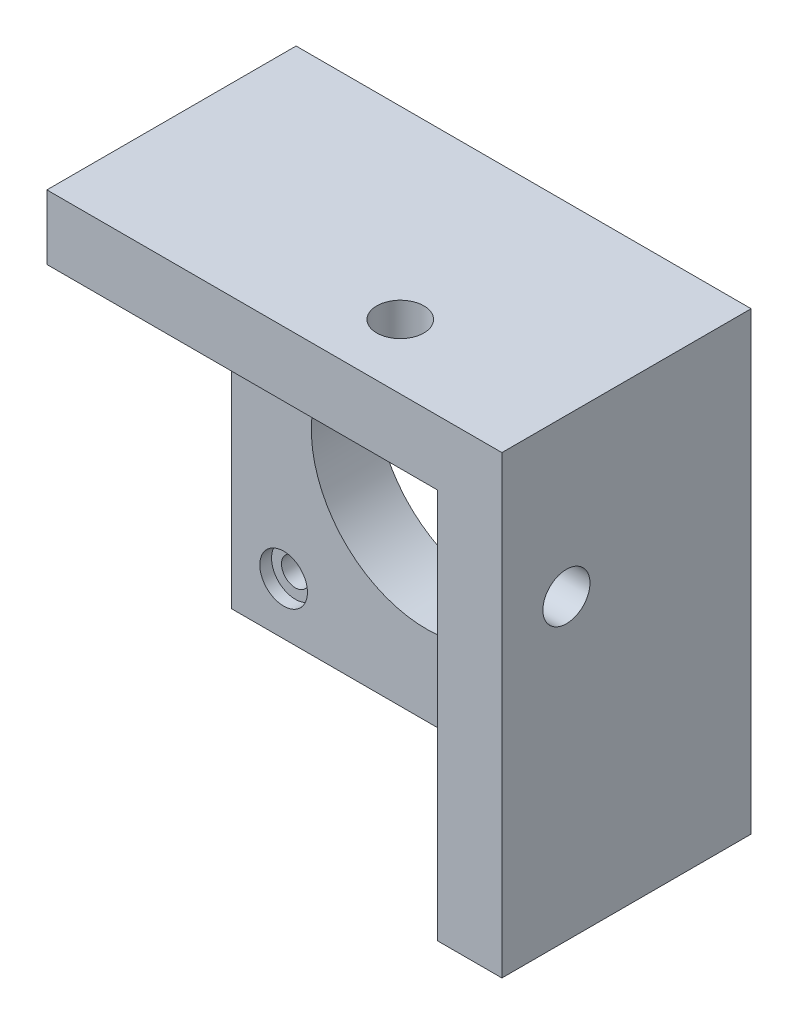
ISO-10303-21;
HEADER;
FILE_DESCRIPTION(('STEP AP214'),'2;1');
FILE_NAME('part.step','',(''),(''),'','','');
FILE_SCHEMA(('AUTOMOTIVE_DESIGN { 1 0 10303 214 1 1 1 1 }'));
ENDSEC;
DATA;
#1=APPLICATION_CONTEXT('core data for automotive mechanical design processes');
#2=APPLICATION_PROTOCOL_DEFINITION('international standard','automotive_design',2000,#1);
#3=PRODUCT_CONTEXT('',#1,'mechanical');
#4=PRODUCT('Part','Part','',(#3));
#5=PRODUCT_RELATED_PRODUCT_CATEGORY('part','',(#4));
#6=PRODUCT_DEFINITION_FORMATION('','',#4);
#7=PRODUCT_DEFINITION_CONTEXT('part definition',#1,'design');
#8=PRODUCT_DEFINITION('design','',#6,#7);
#9=PRODUCT_DEFINITION_SHAPE('','',#8);
#10=(LENGTH_UNIT() NAMED_UNIT(*) SI_UNIT(.MILLI.,.METRE.));
#11=(NAMED_UNIT(*) PLANE_ANGLE_UNIT() SI_UNIT($,.RADIAN.));
#12=(NAMED_UNIT(*) SI_UNIT($,.STERADIAN.) SOLID_ANGLE_UNIT());
#13=UNCERTAINTY_MEASURE_WITH_UNIT(LENGTH_MEASURE(1.E-05),#10,'distance_accuracy_value','');
#14=(GEOMETRIC_REPRESENTATION_CONTEXT(3) GLOBAL_UNCERTAINTY_ASSIGNED_CONTEXT((#13)) GLOBAL_UNIT_ASSIGNED_CONTEXT((#10,
#11,#12)) REPRESENTATION_CONTEXT('',''));
#15=CARTESIAN_POINT('',(0.,0.,0.));
#16=DIRECTION('',(0.,0.,1.));
#17=DIRECTION('',(1.,0.,0.));
#18=AXIS2_PLACEMENT_3D('',#15,#16,#17);
#19=CARTESIAN_POINT('',(21.15,28.15,0.));
#20=DIRECTION('',(0.,1.,0.));
#21=DIRECTION('',(0.,0.,1.));
#22=AXIS2_PLACEMENT_3D('',#19,#20,#21);
#23=PLANE('',#22);
#24=CARTESIAN_POINT('',(10.15,28.15,20.01));
#25=DIRECTION('',(0.,-1.,0.));
#26=DIRECTION('',(0.,0.,-1.));
#27=AXIS2_PLACEMENT_3D('',#24,#25,#26);
#28=CIRCLE('',#27,2.5527);
#29=CARTESIAN_POINT('',(10.15,28.15,17.4573));
#30=VERTEX_POINT('',#29);
#31=EDGE_CURVE('E121',#30,#30,#28,.T.);
#32=ORIENTED_EDGE('',*,*,#31,.T.);
#33=EDGE_LOOP('',(#32));
#34=FACE_BOUND('',#33,.T.);
#35=DIRECTION('',(-1.,0.,0.));
#36=VECTOR('',#35,1.);
#37=CARTESIAN_POINT('',(21.15,28.15,0.));
#38=LINE('',#37,#36);
#39=CARTESIAN_POINT('',(28.15,28.15,0.));
#40=VERTEX_POINT('',#39);
#41=CARTESIAN_POINT('',(-21.15,28.15,0.));
#42=VERTEX_POINT('',#41);
#43=EDGE_CURVE('E147',#40,#42,#38,.T.);
#44=ORIENTED_EDGE('',*,*,#43,.T.);
#45=DIRECTION('',(0.,0.,1.));
#46=VECTOR('',#45,1.);
#47=CARTESIAN_POINT('',(-21.15,28.15,0.));
#48=LINE('',#47,#46);
#49=CARTESIAN_POINT('',(-21.15,28.15,27.));
#50=VERTEX_POINT('',#49);
#51=EDGE_CURVE('E114',#42,#50,#48,.T.);
#52=ORIENTED_EDGE('',*,*,#51,.T.);
#53=DIRECTION('',(-1.,0.,0.));
#54=VECTOR('',#53,1.);
#55=CARTESIAN_POINT('',(21.15,28.15,27.));
#56=LINE('',#55,#54);
#57=CARTESIAN_POINT('',(28.15,28.15,27.));
#58=VERTEX_POINT('',#57);
#59=EDGE_CURVE('E139',#58,#50,#56,.T.);
#60=ORIENTED_EDGE('',*,*,#59,.F.);
#61=DIRECTION('',(0.,0.,1.));
#62=VECTOR('',#61,1.);
#63=CARTESIAN_POINT('',(28.15,28.15,0.));
#64=LINE('',#63,#62);
#65=EDGE_CURVE('E12',#40,#58,#64,.T.);
#66=ORIENTED_EDGE('',*,*,#65,.F.);
#67=EDGE_LOOP('',(#44,#52,#60,#66));
#68=FACE_BOUND('',#67,.T.);
#69=ADVANCED_FACE('F46',(#34,#68),#23,.T.);
#70=CARTESIAN_POINT('',(28.15,21.15,0.));
#71=DIRECTION('',(1.,0.,0.));
#72=DIRECTION('',(0.,0.,-1.));
#73=AXIS2_PLACEMENT_3D('',#70,#71,#72);
#74=PLANE('',#73);
#75=CARTESIAN_POINT('',(28.15,11.15,20.01));
#76=DIRECTION('',(-1.,0.,0.));
#77=DIRECTION('',(0.,0.,1.));
#78=AXIS2_PLACEMENT_3D('',#75,#76,#77);
#79=CIRCLE('',#78,2.5527);
#80=CARTESIAN_POINT('',(28.15,11.15,22.5627));
#81=VERTEX_POINT('',#80);
#82=EDGE_CURVE('E196',#81,#81,#79,.T.);
#83=ORIENTED_EDGE('',*,*,#82,.T.);
#84=EDGE_LOOP('',(#83));
#85=FACE_BOUND('',#84,.T.);
#86=ORIENTED_EDGE('',*,*,#65,.T.);
#87=DIRECTION('',(0.,1.,0.));
#88=VECTOR('',#87,1.);
#89=CARTESIAN_POINT('',(28.15,21.15,27.));
#90=LINE('',#89,#88);
#91=CARTESIAN_POINT('',(28.15,-21.15,27.));
#92=VERTEX_POINT('',#91);
#93=EDGE_CURVE('E136',#92,#58,#90,.T.);
#94=ORIENTED_EDGE('',*,*,#93,.F.);
#95=DIRECTION('',(0.,0.,1.));
#96=VECTOR('',#95,1.);
#97=CARTESIAN_POINT('',(28.15,-21.15,0.));
#98=LINE('',#97,#96);
#99=CARTESIAN_POINT('',(28.15,-21.15,0.));
#100=VERTEX_POINT('',#99);
#101=EDGE_CURVE('E55',#100,#92,#98,.T.);
#102=ORIENTED_EDGE('',*,*,#101,.F.);
#103=DIRECTION('',(0.,1.,0.));
#104=VECTOR('',#103,1.);
#105=CARTESIAN_POINT('',(28.15,21.15,0.));
#106=LINE('',#105,#104);
#107=EDGE_CURVE('E70',#100,#40,#106,.T.);
#108=ORIENTED_EDGE('',*,*,#107,.T.);
#109=EDGE_LOOP('',(#86,#94,#102,#108));
#110=FACE_BOUND('',#109,.T.);
#111=ADVANCED_FACE('F153',(#85,#110),#74,.T.);
#112=CARTESIAN_POINT('',(21.15,-21.15,0.));
#113=DIRECTION('',(0.,-1.,0.));
#114=DIRECTION('',(0.,0.,-1.));
#115=AXIS2_PLACEMENT_3D('',#112,#113,#114);
#116=PLANE('',#115);
#117=ORIENTED_EDGE('',*,*,#101,.T.);
#118=DIRECTION('',(1.,0.,0.));
#119=VECTOR('',#118,1.);
#120=CARTESIAN_POINT('',(21.15,-21.15,27.));
#121=LINE('',#120,#119);
#122=CARTESIAN_POINT('',(21.15,-21.15,27.));
#123=VERTEX_POINT('',#122);
#124=EDGE_CURVE('E104',#123,#92,#121,.T.);
#125=ORIENTED_EDGE('',*,*,#124,.F.);
#126=DIRECTION('',(0.,0.,1.));
#127=VECTOR('',#126,1.);
#128=CARTESIAN_POINT('',(21.15,-21.15,0.));
#129=LINE('',#128,#127);
#130=CARTESIAN_POINT('',(21.15,-21.15,0.));
#131=VERTEX_POINT('',#130);
#132=EDGE_CURVE('E50',#131,#123,#129,.T.);
#133=ORIENTED_EDGE('',*,*,#132,.F.);
#134=DIRECTION('',(1.,0.,0.));
#135=VECTOR('',#134,1.);
#136=CARTESIAN_POINT('',(21.15,-21.15,0.));
#137=LINE('',#136,#135);
#138=EDGE_CURVE('E143',#131,#100,#137,.T.);
#139=ORIENTED_EDGE('',*,*,#138,.T.);
#140=EDGE_LOOP('',(#117,#125,#133,#139));
#141=FACE_BOUND('',#140,.T.);
#142=ADVANCED_FACE('F149',(#141),#116,.T.);
#143=CARTESIAN_POINT('',(21.15,21.15,0.));
#144=DIRECTION('',(-1.,0.,0.));
#145=DIRECTION('',(0.,0.,1.));
#146=AXIS2_PLACEMENT_3D('',#143,#144,#145);
#147=PLANE('',#146);
#148=CARTESIAN_POINT('',(21.15,11.15,20.01));
#149=DIRECTION('',(-1.,0.,0.));
#150=DIRECTION('',(0.,0.,1.));
#151=AXIS2_PLACEMENT_3D('',#148,#149,#150);
#152=CIRCLE('',#151,2.5527);
#153=CARTESIAN_POINT('',(21.15,11.15,22.5627));
#154=VERTEX_POINT('',#153);
#155=EDGE_CURVE('E194',#154,#154,#152,.T.);
#156=ORIENTED_EDGE('',*,*,#155,.F.);
#157=EDGE_LOOP('',(#156));
#158=FACE_BOUND('',#157,.T.);
#159=DIRECTION('',(0.,0.,1.));
#160=VECTOR('',#159,1.);
#161=CARTESIAN_POINT('',(21.15,21.15,0.));
#162=LINE('',#161,#160);
#163=CARTESIAN_POINT('',(21.15,21.15,0.));
#164=VERTEX_POINT('',#163);
#165=CARTESIAN_POINT('',(21.15,21.15,27.));
#166=VERTEX_POINT('',#165);
#167=EDGE_CURVE('E63',#164,#166,#162,.T.);
#168=ORIENTED_EDGE('',*,*,#167,.F.);
#169=DIRECTION('',(0.,-1.,0.));
#170=VECTOR('',#169,1.);
#171=CARTESIAN_POINT('',(21.15,21.15,0.));
#172=LINE('',#171,#170);
#173=EDGE_CURVE('E141',#164,#131,#172,.T.);
#174=ORIENTED_EDGE('',*,*,#173,.T.);
#175=ORIENTED_EDGE('',*,*,#132,.T.);
#176=DIRECTION('',(0.,-1.,0.));
#177=VECTOR('',#176,1.);
#178=CARTESIAN_POINT('',(21.15,21.15,27.));
#179=LINE('',#178,#177);
#180=EDGE_CURVE('E98',#166,#123,#179,.T.);
#181=ORIENTED_EDGE('',*,*,#180,.F.);
#182=EDGE_LOOP('',(#168,#174,#175,#181));
#183=FACE_BOUND('',#182,.T.);
#184=ADVANCED_FACE('F48',(#158,#183),#147,.T.);
#185=CARTESIAN_POINT('',(0.,0.,0.));
#186=DIRECTION('',(0.,0.,-1.));
#187=DIRECTION('',(-1.,0.,0.));
#188=AXIS2_PLACEMENT_3D('',#185,#186,#187);
#189=PLANE('',#188);
#190=ORIENTED_EDGE('',*,*,#173,.F.);
#191=DIRECTION('',(1.,0.,0.));
#192=VECTOR('',#191,1.);
#193=CARTESIAN_POINT('',(21.15,21.15,0.));
#194=LINE('',#193,#192);
#195=CARTESIAN_POINT('',(-21.15,21.15,0.));
#196=VERTEX_POINT('',#195);
#197=EDGE_CURVE('E113',#196,#164,#194,.T.);
#198=ORIENTED_EDGE('',*,*,#197,.F.);
#199=DIRECTION('',(0.,-1.,0.));
#200=VECTOR('',#199,1.);
#201=CARTESIAN_POINT('',(-21.15,21.15,0.));
#202=LINE('',#201,#200);
#203=EDGE_CURVE('E115',#42,#196,#202,.T.);
#204=ORIENTED_EDGE('',*,*,#203,.F.);
#205=ORIENTED_EDGE('',*,*,#43,.F.);
#206=ORIENTED_EDGE('',*,*,#107,.F.);
#207=ORIENTED_EDGE('',*,*,#138,.F.);
#208=EDGE_LOOP('',(#190,#198,#204,#205,#206,#207));
#209=FACE_BOUND('',#208,.T.);
#210=ADVANCED_FACE('F159',(#209),#189,.T.);
#211=CARTESIAN_POINT('',(0.,0.,27.));
#212=DIRECTION('',(0.,0.,-1.));
#213=DIRECTION('',(-1.,0.,0.));
#214=AXIS2_PLACEMENT_3D('',#211,#212,#213);
#215=PLANE('',#214);
#216=ORIENTED_EDGE('',*,*,#59,.T.);
#217=DIRECTION('',(0.,-1.,0.));
#218=VECTOR('',#217,1.);
#219=CARTESIAN_POINT('',(-21.15,21.15,27.));
#220=LINE('',#219,#218);
#221=CARTESIAN_POINT('',(-21.15,21.15,27.));
#222=VERTEX_POINT('',#221);
#223=EDGE_CURVE('E120',#50,#222,#220,.T.);
#224=ORIENTED_EDGE('',*,*,#223,.T.);
#225=DIRECTION('',(1.,0.,0.));
#226=VECTOR('',#225,1.);
#227=CARTESIAN_POINT('',(21.15,21.15,27.));
#228=LINE('',#227,#226);
#229=EDGE_CURVE('E111',#222,#166,#228,.T.);
#230=ORIENTED_EDGE('',*,*,#229,.T.);
#231=ORIENTED_EDGE('',*,*,#180,.T.);
#232=ORIENTED_EDGE('',*,*,#124,.T.);
#233=ORIENTED_EDGE('',*,*,#93,.T.);
#234=EDGE_LOOP('',(#216,#224,#230,#231,#232,#233));
#235=FACE_BOUND('',#234,.T.);
#236=ADVANCED_FACE('F118',(#235),#215,.F.);
#237=CARTESIAN_POINT('',(21.15,21.15,0.));
#238=DIRECTION('',(0.,-1.,0.));
#239=DIRECTION('',(0.,0.,-1.));
#240=AXIS2_PLACEMENT_3D('',#237,#238,#239);
#241=PLANE('',#240);
#242=CARTESIAN_POINT('',(10.15,21.15,20.01));
#243=DIRECTION('',(0.,-1.,0.));
#244=DIRECTION('',(0.,0.,-1.));
#245=AXIS2_PLACEMENT_3D('',#242,#243,#244);
#246=CIRCLE('',#245,2.5527);
#247=CARTESIAN_POINT('',(10.15,21.15,17.4573));
#248=VERTEX_POINT('',#247);
#249=EDGE_CURVE('E125',#248,#248,#246,.T.);
#250=ORIENTED_EDGE('',*,*,#249,.F.);
#251=EDGE_LOOP('',(#250));
#252=FACE_BOUND('',#251,.T.);
#253=ORIENTED_EDGE('',*,*,#167,.T.);
#254=ORIENTED_EDGE('',*,*,#229,.F.);
#255=DIRECTION('',(0.,0.,1.));
#256=VECTOR('',#255,1.);
#257=CARTESIAN_POINT('',(-21.15,21.15,0.));
#258=LINE('',#257,#256);
#259=EDGE_CURVE('E105',#196,#222,#258,.T.);
#260=ORIENTED_EDGE('',*,*,#259,.F.);
#261=ORIENTED_EDGE('',*,*,#197,.T.);
#262=EDGE_LOOP('',(#253,#254,#260,#261));
#263=FACE_BOUND('',#262,.T.);
#264=ADVANCED_FACE('F110',(#252,#263),#241,.T.);
#265=CARTESIAN_POINT('',(-21.15,21.15,0.));
#266=DIRECTION('',(-1.,0.,0.));
#267=DIRECTION('',(0.,0.,1.));
#268=AXIS2_PLACEMENT_3D('',#265,#266,#267);
#269=PLANE('',#268);
#270=ORIENTED_EDGE('',*,*,#259,.T.);
#271=ORIENTED_EDGE('',*,*,#223,.F.);
#272=ORIENTED_EDGE('',*,*,#51,.F.);
#273=ORIENTED_EDGE('',*,*,#203,.T.);
#274=EDGE_LOOP('',(#270,#271,#272,#273));
#275=FACE_BOUND('',#274,.T.);
#276=ADVANCED_FACE('F161',(#275),#269,.T.);
#277=CARTESIAN_POINT('',(10.15,28.15,20.01));
#278=DIRECTION('',(0.,-1.,0.));
#279=DIRECTION('',(0.,0.,-1.));
#280=AXIS2_PLACEMENT_3D('',#277,#278,#279);
#281=CYLINDRICAL_SURFACE('',#280,2.5527);
#282=ORIENTED_EDGE('',*,*,#31,.F.);
#283=EDGE_LOOP('',(#282));
#284=FACE_BOUND('',#283,.T.);
#285=ORIENTED_EDGE('',*,*,#249,.T.);
#286=EDGE_LOOP('',(#285));
#287=FACE_BOUND('',#286,.T.);
#288=ADVANCED_FACE('F163',(#284,#287),#281,.F.);
#289=CARTESIAN_POINT('',(28.15,11.15,20.01));
#290=DIRECTION('',(-1.,0.,0.));
#291=DIRECTION('',(0.,0.,1.));
#292=AXIS2_PLACEMENT_3D('',#289,#290,#291);
#293=CYLINDRICAL_SURFACE('',#292,2.5527);
#294=ORIENTED_EDGE('',*,*,#82,.F.);
#295=EDGE_LOOP('',(#294));
#296=FACE_BOUND('',#295,.T.);
#297=ORIENTED_EDGE('',*,*,#155,.T.);
#298=EDGE_LOOP('',(#297));
#299=FACE_BOUND('',#298,.T.);
#300=ADVANCED_FACE('F169',(#296,#299),#293,.F.);
#301=CLOSED_SHELL('',(#69,#111,#142,#184,#210,#236,#264,#276,#288,#300));
#302=MANIFOLD_SOLID_BREP('B2',#301);
#303=CARTESIAN_POINT('',(-15.5,15.5,0.));
#304=DIRECTION('',(0.,0.,1.));
#305=DIRECTION('',(1.,0.,0.));
#306=AXIS2_PLACEMENT_3D('',#303,#304,#305);
#307=CYLINDRICAL_SURFACE('',#306,1.5);
#308=CARTESIAN_POINT('',(-15.5,15.5,0.));
#309=DIRECTION('',(0.,0.,1.));
#310=DIRECTION('',(1.,0.,0.));
#311=AXIS2_PLACEMENT_3D('',#308,#309,#310);
#312=CIRCLE('',#311,1.5);
#313=CARTESIAN_POINT('',(-14.,15.5,0.));
#314=VERTEX_POINT('',#313);
#315=EDGE_CURVE('E348',#314,#314,#312,.T.);
#316=ORIENTED_EDGE('',*,*,#315,.F.);
#317=EDGE_LOOP('',(#316));
#318=FACE_BOUND('',#317,.T.);
#319=CARTESIAN_POINT('',(-15.5,15.5,5.73));
#320=DIRECTION('',(0.,0.,1.));
#321=DIRECTION('',(1.,0.,0.));
#322=AXIS2_PLACEMENT_3D('',#319,#320,#321);
#323=CIRCLE('',#322,1.5);
#324=CARTESIAN_POINT('',(-14.,15.5,5.73));
#325=VERTEX_POINT('',#324);
#326=EDGE_CURVE('E282',#325,#325,#323,.F.);
#327=ORIENTED_EDGE('',*,*,#326,.F.);
#328=EDGE_LOOP('',(#327));
#329=FACE_BOUND('',#328,.T.);
#330=ADVANCED_FACE('F278',(#318,#329),#307,.F.);
#331=CARTESIAN_POINT('',(15.5,15.5,0.));
#332=DIRECTION('',(0.,0.,1.));
#333=DIRECTION('',(1.,0.,0.));
#334=AXIS2_PLACEMENT_3D('',#331,#332,#333);
#335=CYLINDRICAL_SURFACE('',#334,1.5);
#336=CARTESIAN_POINT('',(15.5,15.5,0.));
#337=DIRECTION('',(0.,0.,1.));
#338=DIRECTION('',(1.,0.,0.));
#339=AXIS2_PLACEMENT_3D('',#336,#337,#338);
#340=CIRCLE('',#339,1.5);
#341=CARTESIAN_POINT('',(17.,15.5,0.));
#342=VERTEX_POINT('',#341);
#343=EDGE_CURVE('E374',#342,#342,#340,.T.);
#344=ORIENTED_EDGE('',*,*,#343,.F.);
#345=EDGE_LOOP('',(#344));
#346=FACE_BOUND('',#345,.T.);
#347=CARTESIAN_POINT('',(15.5,15.5,5.73));
#348=DIRECTION('',(0.,0.,1.));
#349=DIRECTION('',(1.,0.,0.));
#350=AXIS2_PLACEMENT_3D('',#347,#348,#349);
#351=CIRCLE('',#350,1.5);
#352=CARTESIAN_POINT('',(17.,15.5,5.73));
#353=VERTEX_POINT('',#352);
#354=EDGE_CURVE('E360',#353,#353,#351,.F.);
#355=ORIENTED_EDGE('',*,*,#354,.F.);
#356=EDGE_LOOP('',(#355));
#357=FACE_BOUND('',#356,.T.);
#358=ADVANCED_FACE('F397',(#346,#357),#335,.F.);
#359=CARTESIAN_POINT('',(15.5000000000003,-15.5,0.));
#360=DIRECTION('',(0.,0.,1.));
#361=DIRECTION('',(1.,0.,0.));
#362=AXIS2_PLACEMENT_3D('',#359,#360,#361);
#363=CYLINDRICAL_SURFACE('',#362,1.5);
#364=CARTESIAN_POINT('',(15.5000000000003,-15.5,0.));
#365=DIRECTION('',(0.,0.,1.));
#366=DIRECTION('',(1.,0.,0.));
#367=AXIS2_PLACEMENT_3D('',#364,#365,#366);
#368=CIRCLE('',#367,1.5);
#369=CARTESIAN_POINT('',(17.0000000000003,-15.5,0.));
#370=VERTEX_POINT('',#369);
#371=EDGE_CURVE('E369',#370,#370,#368,.T.);
#372=ORIENTED_EDGE('',*,*,#371,.F.);
#373=EDGE_LOOP('',(#372));
#374=FACE_BOUND('',#373,.T.);
#375=CARTESIAN_POINT('',(15.5000000000003,-15.5,5.73));
#376=DIRECTION('',(0.,0.,1.));
#377=DIRECTION('',(1.,0.,0.));
#378=AXIS2_PLACEMENT_3D('',#375,#376,#377);
#379=CIRCLE('',#378,1.5);
#380=CARTESIAN_POINT('',(17.0000000000003,-15.5,5.73));
#381=VERTEX_POINT('',#380);
#382=EDGE_CURVE('E357',#381,#381,#379,.F.);
#383=ORIENTED_EDGE('',*,*,#382,.F.);
#384=EDGE_LOOP('',(#383));
#385=FACE_BOUND('',#384,.T.);
#386=ADVANCED_FACE('F400',(#374,#385),#363,.F.);
#387=CARTESIAN_POINT('',(-15.4999999999997,-15.5,0.));
#388=DIRECTION('',(0.,0.,1.));
#389=DIRECTION('',(1.,0.,0.));
#390=AXIS2_PLACEMENT_3D('',#387,#388,#389);
#391=CYLINDRICAL_SURFACE('',#390,1.5);
#392=CARTESIAN_POINT('',(-15.4999999999997,-15.5,0.));
#393=DIRECTION('',(0.,0.,1.));
#394=DIRECTION('',(1.,0.,0.));
#395=AXIS2_PLACEMENT_3D('',#392,#393,#394);
#396=CIRCLE('',#395,1.5);
#397=CARTESIAN_POINT('',(-13.9999999999997,-15.5,0.));
#398=VERTEX_POINT('',#397);
#399=EDGE_CURVE('E365',#398,#398,#396,.T.);
#400=ORIENTED_EDGE('',*,*,#399,.F.);
#401=EDGE_LOOP('',(#400));
#402=FACE_BOUND('',#401,.T.);
#403=CARTESIAN_POINT('',(-15.4999999999997,-15.5,5.73));
#404=DIRECTION('',(0.,0.,1.));
#405=DIRECTION('',(1.,0.,0.));
#406=AXIS2_PLACEMENT_3D('',#403,#404,#405);
#407=CIRCLE('',#406,1.5);
#408=CARTESIAN_POINT('',(-13.9999999999997,-15.5,5.73));
#409=VERTEX_POINT('',#408);
#410=EDGE_CURVE('E354',#409,#409,#407,.F.);
#411=ORIENTED_EDGE('',*,*,#410,.F.);
#412=EDGE_LOOP('',(#411));
#413=FACE_BOUND('',#412,.T.);
#414=ADVANCED_FACE('F406',(#402,#413),#391,.F.);
#415=CARTESIAN_POINT('',(21.15,-21.15,7.));
#416=DIRECTION('',(-1.,0.,0.));
#417=DIRECTION('',(0.,0.,1.));
#418=AXIS2_PLACEMENT_3D('',#415,#416,#417);
#419=PLANE('',#418);
#420=DIRECTION('',(0.,1.,0.));
#421=VECTOR('',#420,1.);
#422=CARTESIAN_POINT('',(21.15,-21.15,0.));
#423=LINE('',#422,#421);
#424=CARTESIAN_POINT('',(21.15,-21.15,0.));
#425=VERTEX_POINT('',#424);
#426=CARTESIAN_POINT('',(21.15,21.15,0.));
#427=VERTEX_POINT('',#426);
#428=EDGE_CURVE('E345',#425,#427,#423,.T.);
#429=ORIENTED_EDGE('',*,*,#428,.T.);
#430=DIRECTION('',(0.,0.,-1.));
#431=VECTOR('',#430,1.);
#432=CARTESIAN_POINT('',(21.15,21.15,7.));
#433=LINE('',#432,#431);
#434=CARTESIAN_POINT('',(21.15,21.15,7.));
#435=VERTEX_POINT('',#434);
#436=EDGE_CURVE('E44',#435,#427,#433,.T.);
#437=ORIENTED_EDGE('',*,*,#436,.F.);
#438=DIRECTION('',(0.,1.,0.));
#439=VECTOR('',#438,1.);
#440=CARTESIAN_POINT('',(21.15,-21.15,7.));
#441=LINE('',#440,#439);
#442=CARTESIAN_POINT('',(21.15,-21.15,7.));
#443=VERTEX_POINT('',#442);
#444=EDGE_CURVE('E332',#443,#435,#441,.T.);
#445=ORIENTED_EDGE('',*,*,#444,.F.);
#446=DIRECTION('',(0.,0.,-1.));
#447=VECTOR('',#446,1.);
#448=CARTESIAN_POINT('',(21.15,-21.15,7.));
#449=LINE('',#448,#447);
#450=EDGE_CURVE('E341',#443,#425,#449,.T.);
#451=ORIENTED_EDGE('',*,*,#450,.T.);
#452=EDGE_LOOP('',(#429,#437,#445,#451));
#453=FACE_BOUND('',#452,.T.);
#454=ADVANCED_FACE('F280',(#453),#419,.F.);
#455=CARTESIAN_POINT('',(-21.15,21.15,7.));
#456=DIRECTION('',(0.,-1.,0.));
#457=DIRECTION('',(0.,0.,-1.));
#458=AXIS2_PLACEMENT_3D('',#455,#456,#457);
#459=PLANE('',#458);
#460=DIRECTION('',(-1.,0.,0.));
#461=VECTOR('',#460,1.);
#462=CARTESIAN_POINT('',(-21.15,21.15,0.));
#463=LINE('',#462,#461);
#464=CARTESIAN_POINT('',(-21.15,21.15,0.));
#465=VERTEX_POINT('',#464);
#466=EDGE_CURVE('E336',#427,#465,#463,.T.);
#467=ORIENTED_EDGE('',*,*,#466,.T.);
#468=DIRECTION('',(0.,0.,-1.));
#469=VECTOR('',#468,1.);
#470=CARTESIAN_POINT('',(-21.15,21.15,7.));
#471=LINE('',#470,#469);
#472=CARTESIAN_POINT('',(-21.15,21.15,7.));
#473=VERTEX_POINT('',#472);
#474=EDGE_CURVE('E288',#473,#465,#471,.T.);
#475=ORIENTED_EDGE('',*,*,#474,.F.);
#476=DIRECTION('',(-1.,0.,0.));
#477=VECTOR('',#476,1.);
#478=CARTESIAN_POINT('',(-21.15,21.15,7.));
#479=LINE('',#478,#477);
#480=EDGE_CURVE('E327',#435,#473,#479,.T.);
#481=ORIENTED_EDGE('',*,*,#480,.F.);
#482=ORIENTED_EDGE('',*,*,#436,.T.);
#483=EDGE_LOOP('',(#467,#475,#481,#482));
#484=FACE_BOUND('',#483,.T.);
#485=ADVANCED_FACE('F335',(#484),#459,.F.);
#486=CARTESIAN_POINT('',(-21.15,-21.15,7.));
#487=DIRECTION('',(1.,0.,0.));
#488=DIRECTION('',(0.,0.,-1.));
#489=AXIS2_PLACEMENT_3D('',#486,#487,#488);
#490=PLANE('',#489);
#491=DIRECTION('',(0.,-1.,0.));
#492=VECTOR('',#491,1.);
#493=CARTESIAN_POINT('',(-21.15,-21.15,0.));
#494=LINE('',#493,#492);
#495=CARTESIAN_POINT('',(-21.15,-21.15,0.));
#496=VERTEX_POINT('',#495);
#497=EDGE_CURVE('E314',#465,#496,#494,.T.);
#498=ORIENTED_EDGE('',*,*,#497,.T.);
#499=DIRECTION('',(0.,0.,-1.));
#500=VECTOR('',#499,1.);
#501=CARTESIAN_POINT('',(-21.15,-21.15,7.));
#502=LINE('',#501,#500);
#503=CARTESIAN_POINT('',(-21.15,-21.15,7.));
#504=VERTEX_POINT('',#503);
#505=EDGE_CURVE('E337',#504,#496,#502,.T.);
#506=ORIENTED_EDGE('',*,*,#505,.F.);
#507=DIRECTION('',(0.,-1.,0.));
#508=VECTOR('',#507,1.);
#509=CARTESIAN_POINT('',(-21.15,-21.15,7.));
#510=LINE('',#509,#508);
#511=EDGE_CURVE('E330',#473,#504,#510,.T.);
#512=ORIENTED_EDGE('',*,*,#511,.F.);
#513=ORIENTED_EDGE('',*,*,#474,.T.);
#514=EDGE_LOOP('',(#498,#506,#512,#513));
#515=FACE_BOUND('',#514,.T.);
#516=ADVANCED_FACE('F339',(#515),#490,.F.);
#517=CARTESIAN_POINT('',(-21.15,-21.15,7.));
#518=DIRECTION('',(0.,1.,0.));
#519=DIRECTION('',(0.,0.,1.));
#520=AXIS2_PLACEMENT_3D('',#517,#518,#519);
#521=PLANE('',#520);
#522=DIRECTION('',(1.,0.,0.));
#523=VECTOR('',#522,1.);
#524=CARTESIAN_POINT('',(-21.15,-21.15,0.));
#525=LINE('',#524,#523);
#526=EDGE_CURVE('E320',#496,#425,#525,.T.);
#527=ORIENTED_EDGE('',*,*,#526,.T.);
#528=ORIENTED_EDGE('',*,*,#450,.F.);
#529=DIRECTION('',(1.,0.,0.));
#530=VECTOR('',#529,1.);
#531=CARTESIAN_POINT('',(-21.15,-21.15,7.));
#532=LINE('',#531,#530);
#533=EDGE_CURVE('E297',#504,#443,#532,.T.);
#534=ORIENTED_EDGE('',*,*,#533,.F.);
#535=ORIENTED_EDGE('',*,*,#505,.T.);
#536=EDGE_LOOP('',(#527,#528,#534,#535));
#537=FACE_BOUND('',#536,.T.);
#538=ADVANCED_FACE('F420',(#537),#521,.F.);
#539=CARTESIAN_POINT('',(0.,0.,7.));
#540=DIRECTION('',(0.,0.,-1.));
#541=DIRECTION('',(-1.,0.,0.));
#542=AXIS2_PLACEMENT_3D('',#539,#540,#541);
#543=PLANE('',#542);
#544=CARTESIAN_POINT('',(15.5,15.5,7.));
#545=DIRECTION('',(0.,0.,1.));
#546=DIRECTION('',(1.,0.,0.));
#547=AXIS2_PLACEMENT_3D('',#544,#545,#546);
#548=CIRCLE('',#547,2.58);
#549=CARTESIAN_POINT('',(18.08,15.5,7.));
#550=VERTEX_POINT('',#549);
#551=EDGE_CURVE('E583',#550,#550,#548,.T.);
#552=ORIENTED_EDGE('',*,*,#551,.F.);
#553=EDGE_LOOP('',(#552));
#554=FACE_BOUND('',#553,.T.);
#555=CARTESIAN_POINT('',(-15.4999999999997,-15.5,7.));
#556=DIRECTION('',(0.,0.,1.));
#557=DIRECTION('',(1.,0.,0.));
#558=AXIS2_PLACEMENT_3D('',#555,#556,#557);
#559=CIRCLE('',#558,2.58);
#560=CARTESIAN_POINT('',(-12.9199999999997,-15.5,7.));
#561=VERTEX_POINT('',#560);
#562=EDGE_CURVE('E595',#561,#561,#559,.T.);
#563=ORIENTED_EDGE('',*,*,#562,.F.);
#564=EDGE_LOOP('',(#563));
#565=FACE_BOUND('',#564,.T.);
#566=CARTESIAN_POINT('',(15.5000000000003,-15.5,7.));
#567=DIRECTION('',(0.,0.,1.));
#568=DIRECTION('',(1.,0.,0.));
#569=AXIS2_PLACEMENT_3D('',#566,#567,#568);
#570=CIRCLE('',#569,2.58);
#571=CARTESIAN_POINT('',(18.0800000000003,-15.5,7.));
#572=VERTEX_POINT('',#571);
#573=EDGE_CURVE('E590',#572,#572,#570,.T.);
#574=ORIENTED_EDGE('',*,*,#573,.F.);
#575=EDGE_LOOP('',(#574));
#576=FACE_BOUND('',#575,.T.);
#577=CARTESIAN_POINT('',(-15.5,15.5,7.));
#578=DIRECTION('',(0.,0.,1.));
#579=DIRECTION('',(1.,0.,0.));
#580=AXIS2_PLACEMENT_3D('',#577,#578,#579);
#581=CIRCLE('',#580,2.58);
#582=CARTESIAN_POINT('',(-12.92,15.5,7.));
#583=VERTEX_POINT('',#582);
#584=EDGE_CURVE('E390',#583,#583,#581,.T.);
#585=ORIENTED_EDGE('',*,*,#584,.F.);
#586=EDGE_LOOP('',(#585));
#587=FACE_BOUND('',#586,.T.);
#588=CARTESIAN_POINT('',(0.,0.,7.));
#589=DIRECTION('',(0.,0.,1.));
#590=DIRECTION('',(1.,0.,0.));
#591=AXIS2_PLACEMENT_3D('',#588,#589,#590);
#592=CIRCLE('',#591,12.5);
#593=CARTESIAN_POINT('',(12.5,0.,7.));
#594=VERTEX_POINT('',#593);
#595=EDGE_CURVE('E383',#594,#594,#592,.T.);
#596=ORIENTED_EDGE('',*,*,#595,.F.);
#597=EDGE_LOOP('',(#596));
#598=FACE_BOUND('',#597,.T.);
#599=ORIENTED_EDGE('',*,*,#444,.T.);
#600=ORIENTED_EDGE('',*,*,#480,.T.);
#601=ORIENTED_EDGE('',*,*,#511,.T.);
#602=ORIENTED_EDGE('',*,*,#533,.T.);
#603=EDGE_LOOP('',(#599,#600,#601,#602));
#604=FACE_BOUND('',#603,.T.);
#605=ADVANCED_FACE('F328',(#554,#565,#576,#587,#598,#604),#543,.F.);
#606=CARTESIAN_POINT('',(0.,0.,0.));
#607=DIRECTION('',(0.,0.,-1.));
#608=DIRECTION('',(-1.,0.,0.));
#609=AXIS2_PLACEMENT_3D('',#606,#607,#608);
#610=PLANE('',#609);
#611=ORIENTED_EDGE('',*,*,#399,.T.);
#612=EDGE_LOOP('',(#611));
#613=FACE_BOUND('',#612,.T.);
#614=ORIENTED_EDGE('',*,*,#371,.T.);
#615=EDGE_LOOP('',(#614));
#616=FACE_BOUND('',#615,.T.);
#617=ORIENTED_EDGE('',*,*,#343,.T.);
#618=EDGE_LOOP('',(#617));
#619=FACE_BOUND('',#618,.T.);
#620=CARTESIAN_POINT('',(0.,0.,0.));
#621=DIRECTION('',(0.,0.,1.));
#622=DIRECTION('',(1.,0.,0.));
#623=AXIS2_PLACEMENT_3D('',#620,#621,#622);
#624=CIRCLE('',#623,12.5);
#625=CARTESIAN_POINT('',(12.5,0.,0.));
#626=VERTEX_POINT('',#625);
#627=EDGE_CURVE('E379',#626,#626,#624,.T.);
#628=ORIENTED_EDGE('',*,*,#627,.T.);
#629=EDGE_LOOP('',(#628));
#630=FACE_BOUND('',#629,.T.);
#631=ORIENTED_EDGE('',*,*,#315,.T.);
#632=EDGE_LOOP('',(#631));
#633=FACE_BOUND('',#632,.T.);
#634=ORIENTED_EDGE('',*,*,#428,.F.);
#635=ORIENTED_EDGE('',*,*,#526,.F.);
#636=ORIENTED_EDGE('',*,*,#497,.F.);
#637=ORIENTED_EDGE('',*,*,#466,.F.);
#638=EDGE_LOOP('',(#634,#635,#636,#637));
#639=FACE_BOUND('',#638,.T.);
#640=ADVANCED_FACE('F395',(#613,#616,#619,#630,#633,#639),#610,.T.);
#641=CARTESIAN_POINT('',(0.,0.,0.));
#642=DIRECTION('',(0.,0.,1.));
#643=DIRECTION('',(1.,0.,0.));
#644=AXIS2_PLACEMENT_3D('',#641,#642,#643);
#645=CYLINDRICAL_SURFACE('',#644,12.5);
#646=ORIENTED_EDGE('',*,*,#627,.F.);
#647=EDGE_LOOP('',(#646));
#648=FACE_BOUND('',#647,.T.);
#649=ORIENTED_EDGE('',*,*,#595,.T.);
#650=EDGE_LOOP('',(#649));
#651=FACE_BOUND('',#650,.T.);
#652=ADVANCED_FACE('F412',(#648,#651),#645,.F.);
#653=CARTESIAN_POINT('',(-15.4999999999997,-15.5,5.73));
#654=DIRECTION('',(0.,0.,1.));
#655=DIRECTION('',(1.,0.,0.));
#656=AXIS2_PLACEMENT_3D('',#653,#654,#655);
#657=PLANE('',#656);
#658=CARTESIAN_POINT('',(-15.4999999999997,-15.5,5.73));
#659=DIRECTION('',(0.,0.,1.));
#660=DIRECTION('',(1.,0.,0.));
#661=AXIS2_PLACEMENT_3D('',#658,#659,#660);
#662=CIRCLE('',#661,2.58);
#663=CARTESIAN_POINT('',(-12.9199999999997,-15.5,5.73));
#664=VERTEX_POINT('',#663);
#665=EDGE_CURVE('E587',#664,#664,#662,.T.);
#666=ORIENTED_EDGE('',*,*,#665,.T.);
#667=EDGE_LOOP('',(#666));
#668=FACE_BOUND('',#667,.T.);
#669=ORIENTED_EDGE('',*,*,#410,.T.);
#670=EDGE_LOOP('',(#669));
#671=FACE_BOUND('',#670,.T.);
#672=ADVANCED_FACE('F465',(#668,#671),#657,.T.);
#673=CARTESIAN_POINT('',(-15.4999999999997,-15.5,5.73));
#674=DIRECTION('',(0.,0.,1.));
#675=DIRECTION('',(1.,0.,0.));
#676=AXIS2_PLACEMENT_3D('',#673,#674,#675);
#677=CYLINDRICAL_SURFACE('',#676,2.58);
#678=ORIENTED_EDGE('',*,*,#665,.F.);
#679=EDGE_LOOP('',(#678));
#680=FACE_BOUND('',#679,.T.);
#681=ORIENTED_EDGE('',*,*,#562,.T.);
#682=EDGE_LOOP('',(#681));
#683=FACE_BOUND('',#682,.T.);
#684=ADVANCED_FACE('F502',(#680,#683),#677,.F.);
#685=CARTESIAN_POINT('',(15.5000000000003,-15.5,5.73));
#686=DIRECTION('',(0.,0.,1.));
#687=DIRECTION('',(1.,0.,0.));
#688=AXIS2_PLACEMENT_3D('',#685,#686,#687);
#689=PLANE('',#688);
#690=CARTESIAN_POINT('',(15.5000000000003,-15.5,5.73));
#691=DIRECTION('',(0.,0.,1.));
#692=DIRECTION('',(1.,0.,0.));
#693=AXIS2_PLACEMENT_3D('',#690,#691,#692);
#694=CIRCLE('',#693,2.58);
#695=CARTESIAN_POINT('',(18.0800000000003,-15.5,5.73));
#696=VERTEX_POINT('',#695);
#697=EDGE_CURVE('E597',#696,#696,#694,.T.);
#698=ORIENTED_EDGE('',*,*,#697,.T.);
#699=EDGE_LOOP('',(#698));
#700=FACE_BOUND('',#699,.T.);
#701=ORIENTED_EDGE('',*,*,#382,.T.);
#702=EDGE_LOOP('',(#701));
#703=FACE_BOUND('',#702,.T.);
#704=ADVANCED_FACE('F512',(#700,#703),#689,.T.);
#705=CARTESIAN_POINT('',(15.5000000000003,-15.5,5.73));
#706=DIRECTION('',(0.,0.,1.));
#707=DIRECTION('',(1.,0.,0.));
#708=AXIS2_PLACEMENT_3D('',#705,#706,#707);
#709=CYLINDRICAL_SURFACE('',#708,2.58);
#710=ORIENTED_EDGE('',*,*,#697,.F.);
#711=EDGE_LOOP('',(#710));
#712=FACE_BOUND('',#711,.T.);
#713=ORIENTED_EDGE('',*,*,#573,.T.);
#714=EDGE_LOOP('',(#713));
#715=FACE_BOUND('',#714,.T.);
#716=ADVANCED_FACE('F522',(#712,#715),#709,.F.);
#717=CARTESIAN_POINT('',(15.5,15.5,5.73));
#718=DIRECTION('',(0.,0.,1.));
#719=DIRECTION('',(1.,0.,0.));
#720=AXIS2_PLACEMENT_3D('',#717,#718,#719);
#721=PLANE('',#720);
#722=CARTESIAN_POINT('',(15.5,15.5,5.73));
#723=DIRECTION('',(0.,0.,1.));
#724=DIRECTION('',(1.,0.,0.));
#725=AXIS2_PLACEMENT_3D('',#722,#723,#724);
#726=CIRCLE('',#725,2.58);
#727=CARTESIAN_POINT('',(18.08,15.5,5.73));
#728=VERTEX_POINT('',#727);
#729=EDGE_CURVE('E581',#728,#728,#726,.T.);
#730=ORIENTED_EDGE('',*,*,#729,.T.);
#731=EDGE_LOOP('',(#730));
#732=FACE_BOUND('',#731,.T.);
#733=ORIENTED_EDGE('',*,*,#354,.T.);
#734=EDGE_LOOP('',(#733));
#735=FACE_BOUND('',#734,.T.);
#736=ADVANCED_FACE('F532',(#732,#735),#721,.T.);
#737=CARTESIAN_POINT('',(15.5,15.5,5.73));
#738=DIRECTION('',(0.,0.,1.));
#739=DIRECTION('',(1.,0.,0.));
#740=AXIS2_PLACEMENT_3D('',#737,#738,#739);
#741=CYLINDRICAL_SURFACE('',#740,2.58);
#742=ORIENTED_EDGE('',*,*,#729,.F.);
#743=EDGE_LOOP('',(#742));
#744=FACE_BOUND('',#743,.T.);
#745=ORIENTED_EDGE('',*,*,#551,.T.);
#746=EDGE_LOOP('',(#745));
#747=FACE_BOUND('',#746,.T.);
#748=ADVANCED_FACE('F542',(#744,#747),#741,.F.);
#749=CARTESIAN_POINT('',(-15.5,15.5,5.73));
#750=DIRECTION('',(0.,0.,1.));
#751=DIRECTION('',(1.,0.,0.));
#752=AXIS2_PLACEMENT_3D('',#749,#750,#751);
#753=PLANE('',#752);
#754=CARTESIAN_POINT('',(-15.5,15.5,5.73));
#755=DIRECTION('',(0.,0.,1.));
#756=DIRECTION('',(1.,0.,0.));
#757=AXIS2_PLACEMENT_3D('',#754,#755,#756);
#758=CIRCLE('',#757,2.58);
#759=CARTESIAN_POINT('',(-12.92,15.5,5.73));
#760=VERTEX_POINT('',#759);
#761=EDGE_CURVE('E358',#760,#760,#758,.T.);
#762=ORIENTED_EDGE('',*,*,#761,.T.);
#763=EDGE_LOOP('',(#762));
#764=FACE_BOUND('',#763,.T.);
#765=ORIENTED_EDGE('',*,*,#326,.T.);
#766=EDGE_LOOP('',(#765));
#767=FACE_BOUND('',#766,.T.);
#768=ADVANCED_FACE('F552',(#764,#767),#753,.T.);
#769=CARTESIAN_POINT('',(-15.5,15.5,5.73));
#770=DIRECTION('',(0.,0.,1.));
#771=DIRECTION('',(1.,0.,0.));
#772=AXIS2_PLACEMENT_3D('',#769,#770,#771);
#773=CYLINDRICAL_SURFACE('',#772,2.58);
#774=ORIENTED_EDGE('',*,*,#761,.F.);
#775=EDGE_LOOP('',(#774));
#776=FACE_BOUND('',#775,.T.);
#777=ORIENTED_EDGE('',*,*,#584,.T.);
#778=EDGE_LOOP('',(#777));
#779=FACE_BOUND('',#778,.T.);
#780=ADVANCED_FACE('F562',(#776,#779),#773,.F.);
#781=CLOSED_SHELL('',(#330,#358,#386,#414,#454,#485,#516,#538,#605,#640,#652,#672,#684,#704,
#716,#736,#748,#768,#780));
#782=MANIFOLD_SOLID_BREP('B6',#781);
#783=ADVANCED_BREP_SHAPE_REPRESENTATION('',(#18,#302,#782),#14);
#784=SHAPE_DEFINITION_REPRESENTATION(#9,#783);
ENDSEC;
END-ISO-10303-21;
